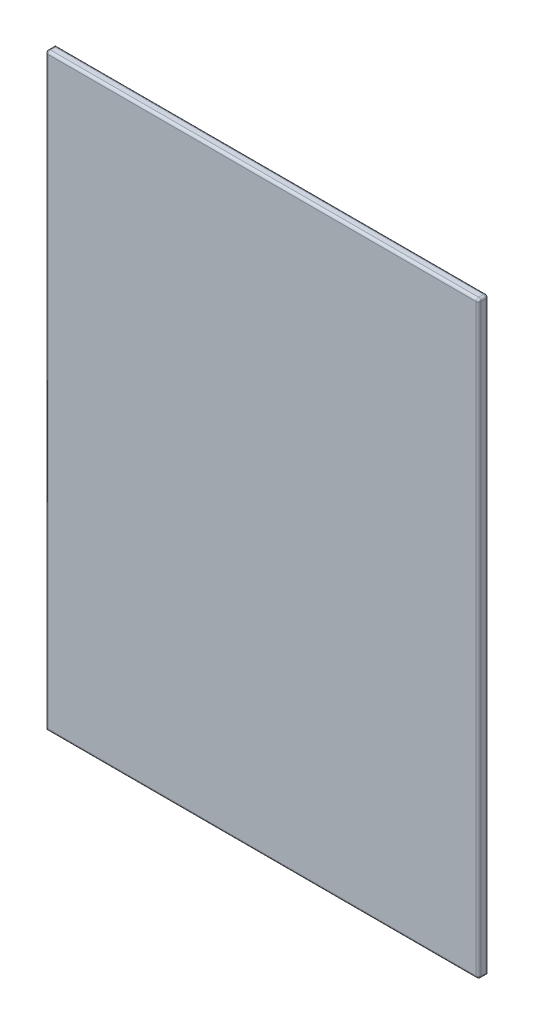
ISO-10303-21;
HEADER;
FILE_DESCRIPTION(('STEP AP214'),'2;1');
FILE_NAME('part.step','',(''),(''),'','','');
FILE_SCHEMA(('AUTOMOTIVE_DESIGN { 1 0 10303 214 1 1 1 1 }'));
ENDSEC;
DATA;
#1=APPLICATION_CONTEXT('core data for automotive mechanical design processes');
#2=APPLICATION_PROTOCOL_DEFINITION('international standard','automotive_design',2000,#1);
#3=PRODUCT_CONTEXT('',#1,'mechanical');
#4=PRODUCT('Part','Part','',(#3));
#5=PRODUCT_RELATED_PRODUCT_CATEGORY('part','',(#4));
#6=PRODUCT_DEFINITION_FORMATION('','',#4);
#7=PRODUCT_DEFINITION_CONTEXT('part definition',#1,'design');
#8=PRODUCT_DEFINITION('design','',#6,#7);
#9=PRODUCT_DEFINITION_SHAPE('','',#8);
#10=(LENGTH_UNIT() NAMED_UNIT(*) SI_UNIT(.MILLI.,.METRE.));
#11=(NAMED_UNIT(*) PLANE_ANGLE_UNIT() SI_UNIT($,.RADIAN.));
#12=(NAMED_UNIT(*) SI_UNIT($,.STERADIAN.) SOLID_ANGLE_UNIT());
#13=UNCERTAINTY_MEASURE_WITH_UNIT(LENGTH_MEASURE(1.E-05),#10,'distance_accuracy_value','');
#14=(GEOMETRIC_REPRESENTATION_CONTEXT(3) GLOBAL_UNCERTAINTY_ASSIGNED_CONTEXT((#13)) GLOBAL_UNIT_ASSIGNED_CONTEXT((#10,
#11,#12)) REPRESENTATION_CONTEXT('',''));
#15=CARTESIAN_POINT('',(0.,0.,0.));
#16=DIRECTION('',(0.,0.,1.));
#17=DIRECTION('',(1.,0.,0.));
#18=AXIS2_PLACEMENT_3D('',#15,#16,#17);
#19=CARTESIAN_POINT('',(437.5,595.,20.));
#20=DIRECTION('',(-1.,0.,0.));
#21=DIRECTION('',(0.,-1.,0.));
#22=AXIS2_PLACEMENT_3D('',#19,#20,#21);
#23=PLANE('',#22);
#24=DIRECTION('',(0.,1.,0.));
#25=VECTOR('',#24,1.);
#26=CARTESIAN_POINT('',(437.5,-595.,15.));
#27=LINE('',#26,#25);
#28=CARTESIAN_POINT('',(437.5,590.,15.));
#29=VERTEX_POINT('',#28);
#30=CARTESIAN_POINT('',(437.5,-590.,15.));
#31=VERTEX_POINT('',#30);
#32=EDGE_CURVE('E139',#29,#31,#27,.F.);
#33=ORIENTED_EDGE('',*,*,#32,.T.);
#34=DIRECTION('',(0.,0.,-1.));
#35=VECTOR('',#34,1.);
#36=CARTESIAN_POINT('',(437.5,-590.,20.));
#37=LINE('',#36,#35);
#38=CARTESIAN_POINT('',(437.5,-590.,5.));
#39=VERTEX_POINT('',#38);
#40=EDGE_CURVE('E146',#31,#39,#37,.T.);
#41=ORIENTED_EDGE('',*,*,#40,.T.);
#42=DIRECTION('',(0.,1.,0.));
#43=VECTOR('',#42,1.);
#44=CARTESIAN_POINT('',(437.5,595.,5.));
#45=LINE('',#44,#43);
#46=CARTESIAN_POINT('',(437.5,590.,5.));
#47=VERTEX_POINT('',#46);
#48=EDGE_CURVE('E142',#39,#47,#45,.T.);
#49=ORIENTED_EDGE('',*,*,#48,.T.);
#50=DIRECTION('',(0.,0.,-1.));
#51=VECTOR('',#50,1.);
#52=CARTESIAN_POINT('',(437.5,590.,20.));
#53=LINE('',#52,#51);
#54=EDGE_CURVE('E119',#47,#29,#53,.F.);
#55=ORIENTED_EDGE('',*,*,#54,.T.);
#56=EDGE_LOOP('',(#33,#41,#49,#55));
#57=FACE_BOUND('',#56,.T.);
#58=ADVANCED_FACE('F39',(#57),#23,.F.);
#59=CARTESIAN_POINT('',(-437.5,595.,20.));
#60=DIRECTION('',(0.,-1.,0.));
#61=DIRECTION('',(0.,0.,-1.));
#62=AXIS2_PLACEMENT_3D('',#59,#60,#61);
#63=PLANE('',#62);
#64=DIRECTION('',(-1.,0.,0.));
#65=VECTOR('',#64,1.);
#66=CARTESIAN_POINT('',(-437.5,595.,5.));
#67=LINE('',#66,#65);
#68=CARTESIAN_POINT('',(432.5,595.,5.));
#69=VERTEX_POINT('',#68);
#70=CARTESIAN_POINT('',(-432.5,595.,5.));
#71=VERTEX_POINT('',#70);
#72=EDGE_CURVE('E160',#69,#71,#67,.T.);
#73=ORIENTED_EDGE('',*,*,#72,.T.);
#74=DIRECTION('',(0.,0.,-1.));
#75=VECTOR('',#74,1.);
#76=CARTESIAN_POINT('',(-432.5,595.,20.));
#77=LINE('',#76,#75);
#78=CARTESIAN_POINT('',(-432.5,595.,15.));
#79=VERTEX_POINT('',#78);
#80=EDGE_CURVE('E164',#71,#79,#77,.F.);
#81=ORIENTED_EDGE('',*,*,#80,.T.);
#82=DIRECTION('',(-1.,0.,0.));
#83=VECTOR('',#82,1.);
#84=CARTESIAN_POINT('',(437.5,595.,15.));
#85=LINE('',#84,#83);
#86=CARTESIAN_POINT('',(432.5,595.,15.));
#87=VERTEX_POINT('',#86);
#88=EDGE_CURVE('E157',#79,#87,#85,.F.);
#89=ORIENTED_EDGE('',*,*,#88,.T.);
#90=DIRECTION('',(0.,0.,-1.));
#91=VECTOR('',#90,1.);
#92=CARTESIAN_POINT('',(432.5,595.,20.));
#93=LINE('',#92,#91);
#94=EDGE_CURVE('E154',#87,#69,#93,.T.);
#95=ORIENTED_EDGE('',*,*,#94,.T.);
#96=EDGE_LOOP('',(#73,#81,#89,#95));
#97=FACE_BOUND('',#96,.T.);
#98=ADVANCED_FACE('F291',(#97),#63,.F.);
#99=CARTESIAN_POINT('',(-437.5,595.,20.));
#100=DIRECTION('',(1.,0.,0.));
#101=DIRECTION('',(0.,1.,0.));
#102=AXIS2_PLACEMENT_3D('',#99,#100,#101);
#103=PLANE('',#102);
#104=DIRECTION('',(0.,0.,-1.));
#105=VECTOR('',#104,1.);
#106=CARTESIAN_POINT('',(-437.5,-595.,20.));
#107=LINE('',#106,#105);
#108=CARTESIAN_POINT('',(-437.5,-595.,15.));
#109=VERTEX_POINT('',#108);
#110=CARTESIAN_POINT('',(-437.5,-595.,0.));
#111=VERTEX_POINT('',#110);
#112=EDGE_CURVE('E113',#109,#111,#107,.T.);
#113=ORIENTED_EDGE('',*,*,#112,.F.);
#114=DIRECTION('',(0.,-1.,0.));
#115=VECTOR('',#114,1.);
#116=CARTESIAN_POINT('',(-437.5,595.,15.));
#117=LINE('',#116,#115);
#118=CARTESIAN_POINT('',(-437.5,590.,15.));
#119=VERTEX_POINT('',#118);
#120=EDGE_CURVE('E63',#109,#119,#117,.F.);
#121=ORIENTED_EDGE('',*,*,#120,.T.);
#122=DIRECTION('',(0.,0.,-1.));
#123=VECTOR('',#122,1.);
#124=CARTESIAN_POINT('',(-437.5,590.,20.));
#125=LINE('',#124,#123);
#126=CARTESIAN_POINT('',(-437.5,590.,0.));
#127=VERTEX_POINT('',#126);
#128=EDGE_CURVE('E125',#119,#127,#125,.T.);
#129=ORIENTED_EDGE('',*,*,#128,.T.);
#130=DIRECTION('',(0.,-1.,0.));
#131=VECTOR('',#130,1.);
#132=CARTESIAN_POINT('',(-437.5,595.,0.));
#133=LINE('',#132,#131);
#134=EDGE_CURVE('E122',#127,#111,#133,.T.);
#135=ORIENTED_EDGE('',*,*,#134,.T.);
#136=EDGE_LOOP('',(#113,#121,#129,#135));
#137=FACE_BOUND('',#136,.T.);
#138=ADVANCED_FACE('F123',(#137),#103,.F.);
#139=CARTESIAN_POINT('',(-437.5,-595.,20.));
#140=DIRECTION('',(0.,1.,0.));
#141=DIRECTION('',(0.,0.,1.));
#142=AXIS2_PLACEMENT_3D('',#139,#140,#141);
#143=PLANE('',#142);
#144=DIRECTION('',(0.,0.,-1.));
#145=VECTOR('',#144,1.);
#146=CARTESIAN_POINT('',(432.5,-595.,20.));
#147=LINE('',#146,#145);
#148=CARTESIAN_POINT('',(432.5,-595.,0.));
#149=VERTEX_POINT('',#148);
#150=CARTESIAN_POINT('',(432.5,-595.,15.));
#151=VERTEX_POINT('',#150);
#152=EDGE_CURVE('E49',#149,#151,#147,.F.);
#153=ORIENTED_EDGE('',*,*,#152,.T.);
#154=DIRECTION('',(1.,0.,0.));
#155=VECTOR('',#154,1.);
#156=CARTESIAN_POINT('',(-437.5,-595.,15.));
#157=LINE('',#156,#155);
#158=EDGE_CURVE('E11',#151,#109,#157,.F.);
#159=ORIENTED_EDGE('',*,*,#158,.T.);
#160=ORIENTED_EDGE('',*,*,#112,.T.);
#161=DIRECTION('',(1.,0.,0.));
#162=VECTOR('',#161,1.);
#163=CARTESIAN_POINT('',(-437.5,-595.,0.));
#164=LINE('',#163,#162);
#165=EDGE_CURVE('E117',#111,#149,#164,.T.);
#166=ORIENTED_EDGE('',*,*,#165,.T.);
#167=EDGE_LOOP('',(#153,#159,#160,#166));
#168=FACE_BOUND('',#167,.T.);
#169=ADVANCED_FACE('F115',(#168),#143,.F.);
#170=CARTESIAN_POINT('',(0.,0.,20.));
#171=DIRECTION('',(0.,0.,1.));
#172=DIRECTION('',(1.,0.,0.));
#173=AXIS2_PLACEMENT_3D('',#170,#171,#172);
#174=PLANE('',#173);
#175=DIRECTION('',(1.,0.,0.));
#176=VECTOR('',#175,1.);
#177=CARTESIAN_POINT('',(437.5,-590.,20.));
#178=LINE('',#177,#176);
#179=CARTESIAN_POINT('',(-432.5,-590.,20.));
#180=VERTEX_POINT('',#179);
#181=CARTESIAN_POINT('',(432.5,-590.,20.));
#182=VERTEX_POINT('',#181);
#183=EDGE_CURVE('E167',#180,#182,#178,.T.);
#184=ORIENTED_EDGE('',*,*,#183,.T.);
#185=DIRECTION('',(0.,1.,0.));
#186=VECTOR('',#185,1.);
#187=CARTESIAN_POINT('',(432.5,595.,20.));
#188=LINE('',#187,#186);
#189=CARTESIAN_POINT('',(432.5,590.,20.));
#190=VERTEX_POINT('',#189);
#191=EDGE_CURVE('E176',#182,#190,#188,.T.);
#192=ORIENTED_EDGE('',*,*,#191,.T.);
#193=DIRECTION('',(-1.,0.,0.));
#194=VECTOR('',#193,1.);
#195=CARTESIAN_POINT('',(-437.5,590.,20.));
#196=LINE('',#195,#194);
#197=CARTESIAN_POINT('',(-432.5,590.,20.));
#198=VERTEX_POINT('',#197);
#199=EDGE_CURVE('E173',#190,#198,#196,.T.);
#200=ORIENTED_EDGE('',*,*,#199,.T.);
#201=DIRECTION('',(0.,-1.,0.));
#202=VECTOR('',#201,1.);
#203=CARTESIAN_POINT('',(-432.5,-595.,20.));
#204=LINE('',#203,#202);
#205=EDGE_CURVE('E170',#198,#180,#204,.T.);
#206=ORIENTED_EDGE('',*,*,#205,.T.);
#207=EDGE_LOOP('',(#184,#192,#200,#206));
#208=FACE_BOUND('',#207,.T.);
#209=ADVANCED_FACE('F283',(#208),#174,.T.);
#210=CARTESIAN_POINT('',(0.,0.,0.));
#211=DIRECTION('',(0.,0.,1.));
#212=DIRECTION('',(1.,0.,0.));
#213=AXIS2_PLACEMENT_3D('',#210,#211,#212);
#214=PLANE('',#213);
#215=DIRECTION('',(-1.,0.,0.));
#216=VECTOR('',#215,1.);
#217=CARTESIAN_POINT('',(0.,590.,0.));
#218=LINE('',#217,#216);
#219=CARTESIAN_POINT('',(432.5,590.,0.));
#220=VERTEX_POINT('',#219);
#221=EDGE_CURVE('E149',#127,#220,#218,.F.);
#222=ORIENTED_EDGE('',*,*,#221,.T.);
#223=DIRECTION('',(0.,1.,0.));
#224=VECTOR('',#223,1.);
#225=CARTESIAN_POINT('',(432.5,0.,0.));
#226=LINE('',#225,#224);
#227=EDGE_CURVE('E133',#220,#149,#226,.F.);
#228=ORIENTED_EDGE('',*,*,#227,.T.);
#229=ORIENTED_EDGE('',*,*,#165,.F.);
#230=ORIENTED_EDGE('',*,*,#134,.F.);
#231=EDGE_LOOP('',(#222,#228,#229,#230));
#232=FACE_BOUND('',#231,.T.);
#233=ADVANCED_FACE('F131',(#232),#214,.F.);
#234=CARTESIAN_POINT('',(-432.5,0.,15.));
#235=DIRECTION('',(0.,1.,0.));
#236=DIRECTION('',(-1.,0.,0.));
#237=AXIS2_PLACEMENT_3D('',#234,#235,#236);
#238=CYLINDRICAL_SURFACE('',#237,5.);
#239=CARTESIAN_POINT('',(-432.5,-590.,15.));
#240=DIRECTION('',(-0.707106781186547,0.707106781186547,0.));
#241=DIRECTION('',(-0.707106781186547,-0.707106781186548,0.));
#242=AXIS2_PLACEMENT_3D('',#239,#240,#241);
#243=ELLIPSE('',#242,7.07106781186547,5.);
#244=EDGE_CURVE('E230',#180,#109,#243,.F.);
#245=ORIENTED_EDGE('',*,*,#244,.F.);
#246=ORIENTED_EDGE('',*,*,#205,.F.);
#247=CARTESIAN_POINT('',(-432.5,590.,15.));
#248=DIRECTION('',(0.,1.,0.));
#249=DIRECTION('',(0.,0.,1.));
#250=AXIS2_PLACEMENT_3D('',#247,#248,#249);
#251=CIRCLE('',#250,5.);
#252=EDGE_CURVE('E233',#119,#198,#251,.T.);
#253=ORIENTED_EDGE('',*,*,#252,.F.);
#254=ORIENTED_EDGE('',*,*,#120,.F.);
#255=EDGE_LOOP('',(#245,#246,#253,#254));
#256=FACE_BOUND('',#255,.T.);
#257=ADVANCED_FACE('F41',(#256),#238,.T.);
#258=CARTESIAN_POINT('',(0.,590.,15.));
#259=DIRECTION('',(1.,0.,0.));
#260=DIRECTION('',(0.,0.,-1.));
#261=AXIS2_PLACEMENT_3D('',#258,#259,#260);
#262=CYLINDRICAL_SURFACE('',#261,5.);
#263=CARTESIAN_POINT('',(-432.5,590.,15.));
#264=DIRECTION('',(-1.,0.,0.));
#265=DIRECTION('',(0.,0.,1.));
#266=AXIS2_PLACEMENT_3D('',#263,#264,#265);
#267=CIRCLE('',#266,5.);
#268=EDGE_CURVE('E43',#198,#79,#267,.T.);
#269=ORIENTED_EDGE('',*,*,#268,.F.);
#270=ORIENTED_EDGE('',*,*,#199,.F.);
#271=CARTESIAN_POINT('',(432.5,590.,15.));
#272=DIRECTION('',(1.,0.,0.));
#273=DIRECTION('',(0.,0.,-1.));
#274=AXIS2_PLACEMENT_3D('',#271,#272,#273);
#275=CIRCLE('',#274,5.);
#276=EDGE_CURVE('E223',#87,#190,#275,.T.);
#277=ORIENTED_EDGE('',*,*,#276,.F.);
#278=ORIENTED_EDGE('',*,*,#88,.F.);
#279=EDGE_LOOP('',(#269,#270,#277,#278));
#280=FACE_BOUND('',#279,.T.);
#281=ADVANCED_FACE('F286',(#280),#262,.T.);
#282=CARTESIAN_POINT('',(-432.5,590.,15.));
#283=DIRECTION('',(0.,0.,1.));
#284=DIRECTION('',(1.,0.,0.));
#285=AXIS2_PLACEMENT_3D('',#282,#283,#284);
#286=SPHERICAL_SURFACE('',#285,5.);
#287=ORIENTED_EDGE('',*,*,#252,.T.);
#288=ORIENTED_EDGE('',*,*,#268,.T.);
#289=CARTESIAN_POINT('',(-432.5,590.,15.));
#290=DIRECTION('',(0.,0.,1.));
#291=DIRECTION('',(1.,0.,0.));
#292=AXIS2_PLACEMENT_3D('',#289,#290,#291);
#293=CIRCLE('',#292,5.);
#294=EDGE_CURVE('E219',#119,#79,#293,.F.);
#295=ORIENTED_EDGE('',*,*,#294,.F.);
#296=EDGE_LOOP('',(#287,#288,#295));
#297=FACE_BOUND('',#296,.T.);
#298=ADVANCED_FACE('F241',(#297),#286,.T.);
#299=CARTESIAN_POINT('',(0.,-590.,15.));
#300=DIRECTION('',(-1.,0.,0.));
#301=DIRECTION('',(0.,0.,1.));
#302=AXIS2_PLACEMENT_3D('',#299,#300,#301);
#303=CYLINDRICAL_SURFACE('',#302,5.);
#304=ORIENTED_EDGE('',*,*,#244,.T.);
#305=ORIENTED_EDGE('',*,*,#158,.F.);
#306=CARTESIAN_POINT('',(432.5,-590.,15.));
#307=DIRECTION('',(1.,0.,0.));
#308=DIRECTION('',(0.,0.,-1.));
#309=AXIS2_PLACEMENT_3D('',#306,#307,#308);
#310=CIRCLE('',#309,5.);
#311=EDGE_CURVE('E215',#182,#151,#310,.T.);
#312=ORIENTED_EDGE('',*,*,#311,.F.);
#313=ORIENTED_EDGE('',*,*,#183,.F.);
#314=EDGE_LOOP('',(#304,#305,#312,#313));
#315=FACE_BOUND('',#314,.T.);
#316=ADVANCED_FACE('F278',(#315),#303,.T.);
#317=CARTESIAN_POINT('',(432.5,0.,15.));
#318=DIRECTION('',(0.,-1.,0.));
#319=DIRECTION('',(1.,0.,0.));
#320=AXIS2_PLACEMENT_3D('',#317,#318,#319);
#321=CYLINDRICAL_SURFACE('',#320,5.);
#322=CARTESIAN_POINT('',(432.5,590.,15.));
#323=DIRECTION('',(0.,1.,0.));
#324=DIRECTION('',(0.,0.,1.));
#325=AXIS2_PLACEMENT_3D('',#322,#323,#324);
#326=CIRCLE('',#325,5.);
#327=EDGE_CURVE('E226',#190,#29,#326,.T.);
#328=ORIENTED_EDGE('',*,*,#327,.F.);
#329=ORIENTED_EDGE('',*,*,#191,.F.);
#330=CARTESIAN_POINT('',(432.5,-590.,15.));
#331=DIRECTION('',(0.,-1.,0.));
#332=DIRECTION('',(0.,0.,-1.));
#333=AXIS2_PLACEMENT_3D('',#330,#331,#332);
#334=CIRCLE('',#333,5.);
#335=EDGE_CURVE('E211',#31,#182,#334,.T.);
#336=ORIENTED_EDGE('',*,*,#335,.F.);
#337=ORIENTED_EDGE('',*,*,#32,.F.);
#338=EDGE_LOOP('',(#328,#329,#336,#337));
#339=FACE_BOUND('',#338,.T.);
#340=ADVANCED_FACE('F318',(#339),#321,.T.);
#341=CARTESIAN_POINT('',(432.5,590.,15.));
#342=DIRECTION('',(0.,0.,1.));
#343=DIRECTION('',(1.,0.,0.));
#344=AXIS2_PLACEMENT_3D('',#341,#342,#343);
#345=SPHERICAL_SURFACE('',#344,5.);
#346=ORIENTED_EDGE('',*,*,#276,.T.);
#347=ORIENTED_EDGE('',*,*,#327,.T.);
#348=CARTESIAN_POINT('',(432.5,590.,15.));
#349=DIRECTION('',(0.,0.,1.));
#350=DIRECTION('',(1.,0.,0.));
#351=AXIS2_PLACEMENT_3D('',#348,#349,#350);
#352=CIRCLE('',#351,5.);
#353=EDGE_CURVE('E207',#87,#29,#352,.F.);
#354=ORIENTED_EDGE('',*,*,#353,.F.);
#355=EDGE_LOOP('',(#346,#347,#354));
#356=FACE_BOUND('',#355,.T.);
#357=ADVANCED_FACE('F289',(#356),#345,.T.);
#358=CARTESIAN_POINT('',(-432.5,590.,20.));
#359=DIRECTION('',(0.,0.,-1.));
#360=DIRECTION('',(-1.,0.,0.));
#361=AXIS2_PLACEMENT_3D('',#358,#359,#360);
#362=CYLINDRICAL_SURFACE('',#361,5.);
#363=ORIENTED_EDGE('',*,*,#294,.T.);
#364=ORIENTED_EDGE('',*,*,#80,.F.);
#365=CARTESIAN_POINT('',(-432.5,590.,5.));
#366=DIRECTION('',(0.707106781186547,0.,-0.707106781186547));
#367=DIRECTION('',(-0.707106781186547,0.,-0.707106781186547));
#368=AXIS2_PLACEMENT_3D('',#365,#366,#367);
#369=ELLIPSE('',#368,7.07106781186547,5.);
#370=EDGE_CURVE('E204',#127,#71,#369,.T.);
#371=ORIENTED_EDGE('',*,*,#370,.F.);
#372=ORIENTED_EDGE('',*,*,#128,.F.);
#373=EDGE_LOOP('',(#363,#364,#371,#372));
#374=FACE_BOUND('',#373,.T.);
#375=ADVANCED_FACE('F247',(#374),#362,.T.);
#376=CARTESIAN_POINT('',(432.5,-590.,15.));
#377=DIRECTION('',(0.,0.,1.));
#378=DIRECTION('',(1.,0.,0.));
#379=AXIS2_PLACEMENT_3D('',#376,#377,#378);
#380=SPHERICAL_SURFACE('',#379,5.);
#381=ORIENTED_EDGE('',*,*,#335,.T.);
#382=ORIENTED_EDGE('',*,*,#311,.T.);
#383=CARTESIAN_POINT('',(432.5,-590.,15.));
#384=DIRECTION('',(0.,0.,1.));
#385=DIRECTION('',(1.,0.,0.));
#386=AXIS2_PLACEMENT_3D('',#383,#384,#385);
#387=CIRCLE('',#386,5.);
#388=EDGE_CURVE('E200',#31,#151,#387,.F.);
#389=ORIENTED_EDGE('',*,*,#388,.F.);
#390=EDGE_LOOP('',(#381,#382,#389));
#391=FACE_BOUND('',#390,.T.);
#392=ADVANCED_FACE('F274',(#391),#380,.T.);
#393=CARTESIAN_POINT('',(432.5,590.,20.));
#394=DIRECTION('',(0.,0.,-1.));
#395=DIRECTION('',(-1.,0.,0.));
#396=AXIS2_PLACEMENT_3D('',#393,#394,#395);
#397=CYLINDRICAL_SURFACE('',#396,5.);
#398=ORIENTED_EDGE('',*,*,#353,.T.);
#399=ORIENTED_EDGE('',*,*,#54,.F.);
#400=CARTESIAN_POINT('',(432.5,590.,5.));
#401=DIRECTION('',(0.,0.,-1.));
#402=DIRECTION('',(-1.,0.,0.));
#403=AXIS2_PLACEMENT_3D('',#400,#401,#402);
#404=CIRCLE('',#403,5.);
#405=EDGE_CURVE('E196',#69,#47,#404,.T.);
#406=ORIENTED_EDGE('',*,*,#405,.F.);
#407=ORIENTED_EDGE('',*,*,#94,.F.);
#408=EDGE_LOOP('',(#398,#399,#406,#407));
#409=FACE_BOUND('',#408,.T.);
#410=ADVANCED_FACE('F264',(#409),#397,.T.);
#411=CARTESIAN_POINT('',(-437.5,590.,5.));
#412=DIRECTION('',(-1.,0.,0.));
#413=DIRECTION('',(0.,0.,1.));
#414=AXIS2_PLACEMENT_3D('',#411,#412,#413);
#415=CYLINDRICAL_SURFACE('',#414,5.);
#416=ORIENTED_EDGE('',*,*,#370,.T.);
#417=ORIENTED_EDGE('',*,*,#72,.F.);
#418=CARTESIAN_POINT('',(432.5,590.,5.));
#419=DIRECTION('',(1.,0.,0.));
#420=DIRECTION('',(0.,1.,0.));
#421=AXIS2_PLACEMENT_3D('',#418,#419,#420);
#422=CIRCLE('',#421,5.);
#423=EDGE_CURVE('E192',#220,#69,#422,.T.);
#424=ORIENTED_EDGE('',*,*,#423,.F.);
#425=ORIENTED_EDGE('',*,*,#221,.F.);
#426=EDGE_LOOP('',(#416,#417,#424,#425));
#427=FACE_BOUND('',#426,.T.);
#428=ADVANCED_FACE('F252',(#427),#415,.T.);
#429=CARTESIAN_POINT('',(432.5,-590.,20.));
#430=DIRECTION('',(0.,0.,-1.));
#431=DIRECTION('',(-1.,0.,0.));
#432=AXIS2_PLACEMENT_3D('',#429,#430,#431);
#433=CYLINDRICAL_SURFACE('',#432,5.);
#434=ORIENTED_EDGE('',*,*,#388,.T.);
#435=ORIENTED_EDGE('',*,*,#152,.F.);
#436=CARTESIAN_POINT('',(432.5,-590.,5.));
#437=DIRECTION('',(0.,0.707106781186547,-0.707106781186547));
#438=DIRECTION('',(0.,-0.707106781186547,-0.707106781186547));
#439=AXIS2_PLACEMENT_3D('',#436,#437,#438);
#440=ELLIPSE('',#439,7.07106781186547,5.);
#441=EDGE_CURVE('E189',#39,#149,#440,.T.);
#442=ORIENTED_EDGE('',*,*,#441,.F.);
#443=ORIENTED_EDGE('',*,*,#40,.F.);
#444=EDGE_LOOP('',(#434,#435,#442,#443));
#445=FACE_BOUND('',#444,.T.);
#446=ADVANCED_FACE('F271',(#445),#433,.T.);
#447=CARTESIAN_POINT('',(432.5,590.,5.));
#448=DIRECTION('',(0.,1.,0.));
#449=DIRECTION('',(-1.,0.,0.));
#450=AXIS2_PLACEMENT_3D('',#447,#448,#449);
#451=SPHERICAL_SURFACE('',#450,5.);
#452=ORIENTED_EDGE('',*,*,#423,.T.);
#453=ORIENTED_EDGE('',*,*,#405,.T.);
#454=CARTESIAN_POINT('',(432.5,590.,5.));
#455=DIRECTION('',(0.,1.,0.));
#456=DIRECTION('',(0.,0.,1.));
#457=AXIS2_PLACEMENT_3D('',#454,#455,#456);
#458=CIRCLE('',#457,5.);
#459=EDGE_CURVE('E186',#220,#47,#458,.F.);
#460=ORIENTED_EDGE('',*,*,#459,.F.);
#461=EDGE_LOOP('',(#452,#453,#460));
#462=FACE_BOUND('',#461,.T.);
#463=ADVANCED_FACE('F260',(#462),#451,.T.);
#464=CARTESIAN_POINT('',(432.5,595.,5.));
#465=DIRECTION('',(0.,1.,0.));
#466=DIRECTION('',(-1.,0.,0.));
#467=AXIS2_PLACEMENT_3D('',#464,#465,#466);
#468=CYLINDRICAL_SURFACE('',#467,5.);
#469=ORIENTED_EDGE('',*,*,#441,.T.);
#470=ORIENTED_EDGE('',*,*,#227,.F.);
#471=ORIENTED_EDGE('',*,*,#459,.T.);
#472=ORIENTED_EDGE('',*,*,#48,.F.);
#473=EDGE_LOOP('',(#469,#470,#471,#472));
#474=FACE_BOUND('',#473,.T.);
#475=ADVANCED_FACE('F257',(#474),#468,.T.);
#476=CLOSED_SHELL('',(#58,#98,#138,#169,#209,#233,#257,#281,#298,#316,#340,#357,#375,#392,#410,
#428,#446,#463,#475));
#477=MANIFOLD_SOLID_BREP('B2',#476);
#478=ADVANCED_BREP_SHAPE_REPRESENTATION('',(#18,#477),#14);
#479=SHAPE_DEFINITION_REPRESENTATION(#9,#478);
ENDSEC;
END-ISO-10303-21;
